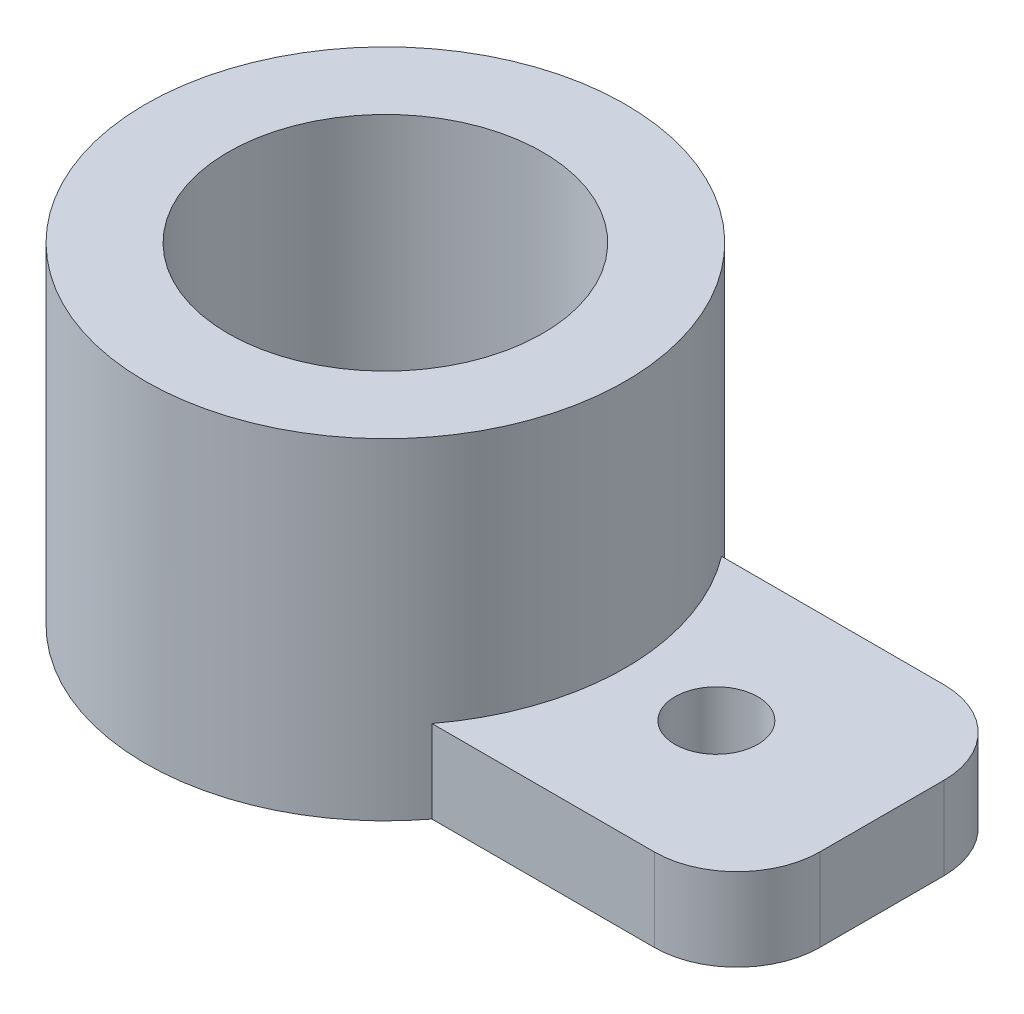
ISO-10303-21;
HEADER;
FILE_DESCRIPTION(('STEP AP214'),'2;1');
FILE_NAME('part.step','',(''),(''),'','','');
FILE_SCHEMA(('AUTOMOTIVE_DESIGN { 1 0 10303 214 1 1 1 1 }'));
ENDSEC;
DATA;
#1=APPLICATION_CONTEXT('core data for automotive mechanical design processes');
#2=APPLICATION_PROTOCOL_DEFINITION('international standard','automotive_design',2000,#1);
#3=PRODUCT_CONTEXT('',#1,'mechanical');
#4=PRODUCT('Part','Part','',(#3));
#5=PRODUCT_RELATED_PRODUCT_CATEGORY('part','',(#4));
#6=PRODUCT_DEFINITION_FORMATION('','',#4);
#7=PRODUCT_DEFINITION_CONTEXT('part definition',#1,'design');
#8=PRODUCT_DEFINITION('design','',#6,#7);
#9=PRODUCT_DEFINITION_SHAPE('','',#8);
#10=(LENGTH_UNIT() NAMED_UNIT(*) SI_UNIT(.MILLI.,.METRE.));
#11=(NAMED_UNIT(*) PLANE_ANGLE_UNIT() SI_UNIT($,.RADIAN.));
#12=(NAMED_UNIT(*) SI_UNIT($,.STERADIAN.) SOLID_ANGLE_UNIT());
#13=UNCERTAINTY_MEASURE_WITH_UNIT(LENGTH_MEASURE(1.E-05),#10,'distance_accuracy_value','');
#14=(GEOMETRIC_REPRESENTATION_CONTEXT(3) GLOBAL_UNCERTAINTY_ASSIGNED_CONTEXT((#13)) GLOBAL_UNIT_ASSIGNED_CONTEXT((#10,
#11,#12)) REPRESENTATION_CONTEXT('',''));
#15=CARTESIAN_POINT('',(0.,0.,0.));
#16=DIRECTION('',(0.,0.,1.));
#17=DIRECTION('',(1.,0.,0.));
#18=AXIS2_PLACEMENT_3D('',#15,#16,#17);
#19=CARTESIAN_POINT('',(0.,4.,0.));
#20=DIRECTION('',(0.,-1.,0.));
#21=DIRECTION('',(0.,0.,-1.));
#22=AXIS2_PLACEMENT_3D('',#19,#20,#21);
#23=CYLINDRICAL_SURFACE('',#22,1.);
#24=CARTESIAN_POINT('',(0.,0.,0.));
#25=DIRECTION('',(0.,1.,0.));
#26=DIRECTION('',(0.,0.,1.));
#27=AXIS2_PLACEMENT_3D('',#24,#25,#26);
#28=CIRCLE('',#27,1.);
#29=CARTESIAN_POINT('',(0.,0.,1.));
#30=VERTEX_POINT('',#29);
#31=EDGE_CURVE('E136',#30,#30,#28,.T.);
#32=ORIENTED_EDGE('',*,*,#31,.F.);
#33=EDGE_LOOP('',(#32));
#34=FACE_BOUND('',#33,.T.);
#35=CARTESIAN_POINT('',(0.,1.,0.));
#36=DIRECTION('',(0.,1.,0.));
#37=DIRECTION('',(0.,0.,1.));
#38=AXIS2_PLACEMENT_3D('',#35,#36,#37);
#39=CIRCLE('',#38,1.);
#40=CARTESIAN_POINT('',(0.,1.,1.));
#41=VERTEX_POINT('',#40);
#42=EDGE_CURVE('E137',#41,#41,#39,.T.);
#43=ORIENTED_EDGE('',*,*,#42,.T.);
#44=EDGE_LOOP('',(#43));
#45=FACE_BOUND('',#44,.T.);
#46=ADVANCED_FACE('F39',(#34,#45),#23,.F.);
#47=CARTESIAN_POINT('',(0.,4.,0.));
#48=DIRECTION('',(0.,-1.,0.));
#49=DIRECTION('',(0.,0.,-1.));
#50=AXIS2_PLACEMENT_3D('',#47,#48,#49);
#51=CYLINDRICAL_SURFACE('',#50,2.9);
#52=CARTESIAN_POINT('',(0.,4.,0.));
#53=DIRECTION('',(0.,1.,0.));
#54=DIRECTION('',(0.,0.,1.));
#55=AXIS2_PLACEMENT_3D('',#52,#53,#54);
#56=CIRCLE('',#55,2.9);
#57=CARTESIAN_POINT('',(0.,4.,2.9));
#58=VERTEX_POINT('',#57);
#59=EDGE_CURVE('E110',#58,#58,#56,.T.);
#60=ORIENTED_EDGE('',*,*,#59,.F.);
#61=EDGE_LOOP('',(#60));
#62=FACE_BOUND('',#61,.T.);
#63=DIRECTION('',(0.,-1.,0.));
#64=VECTOR('',#63,1.);
#65=CARTESIAN_POINT('',(2.31246621596944,4.,1.75));
#66=LINE('',#65,#64);
#67=CARTESIAN_POINT('',(2.31246621596944,1.,1.75));
#68=VERTEX_POINT('',#67);
#69=CARTESIAN_POINT('',(2.31246621596944,0.,1.75));
#70=VERTEX_POINT('',#69);
#71=EDGE_CURVE('E111',#68,#70,#66,.T.);
#72=ORIENTED_EDGE('',*,*,#71,.F.);
#73=CARTESIAN_POINT('',(0.,1.,0.));
#74=DIRECTION('',(0.,1.,0.));
#75=DIRECTION('',(0.,0.,1.));
#76=AXIS2_PLACEMENT_3D('',#73,#74,#75);
#77=CIRCLE('',#76,2.9);
#78=CARTESIAN_POINT('',(2.31246621596944,1.,-1.75));
#79=VERTEX_POINT('',#78);
#80=EDGE_CURVE('E116',#68,#79,#77,.T.);
#81=ORIENTED_EDGE('',*,*,#80,.T.);
#82=DIRECTION('',(0.,-1.,0.));
#83=VECTOR('',#82,1.);
#84=CARTESIAN_POINT('',(2.31246621596944,4.,-1.75));
#85=LINE('',#84,#83);
#86=CARTESIAN_POINT('',(2.31246621596944,0.,-1.75));
#87=VERTEX_POINT('',#86);
#88=EDGE_CURVE('E96',#87,#79,#85,.F.);
#89=ORIENTED_EDGE('',*,*,#88,.F.);
#90=CARTESIAN_POINT('',(0.,0.,0.));
#91=DIRECTION('',(0.,1.,0.));
#92=DIRECTION('',(0.,0.,1.));
#93=AXIS2_PLACEMENT_3D('',#90,#91,#92);
#94=CIRCLE('',#93,2.9);
#95=EDGE_CURVE('E104',#87,#70,#94,.T.);
#96=ORIENTED_EDGE('',*,*,#95,.T.);
#97=EDGE_LOOP('',(#72,#81,#89,#96));
#98=FACE_BOUND('',#97,.T.);
#99=ADVANCED_FACE('F114',(#62,#98),#51,.T.);
#100=CARTESIAN_POINT('',(0.,4.,0.));
#101=DIRECTION('',(0.,1.,0.));
#102=DIRECTION('',(0.,0.,1.));
#103=AXIS2_PLACEMENT_3D('',#100,#101,#102);
#104=PLANE('',#103);
#105=CARTESIAN_POINT('',(0.,4.,0.));
#106=DIRECTION('',(0.,1.,0.));
#107=DIRECTION('',(0.,0.,1.));
#108=AXIS2_PLACEMENT_3D('',#105,#106,#107);
#109=CIRCLE('',#108,1.9);
#110=CARTESIAN_POINT('',(0.,4.,1.9));
#111=VERTEX_POINT('',#110);
#112=EDGE_CURVE('E181',#111,#111,#109,.T.);
#113=ORIENTED_EDGE('',*,*,#112,.F.);
#114=EDGE_LOOP('',(#113));
#115=FACE_BOUND('',#114,.T.);
#116=ORIENTED_EDGE('',*,*,#59,.T.);
#117=EDGE_LOOP('',(#116));
#118=FACE_BOUND('',#117,.T.);
#119=ADVANCED_FACE('F221',(#115,#118),#104,.T.);
#120=CARTESIAN_POINT('',(0.,0.,0.));
#121=DIRECTION('',(0.,1.,0.));
#122=DIRECTION('',(0.,0.,1.));
#123=AXIS2_PLACEMENT_3D('',#120,#121,#122);
#124=PLANE('',#123);
#125=CARTESIAN_POINT('',(4.,0.,0.));
#126=DIRECTION('',(0.,1.,0.));
#127=DIRECTION('',(0.,0.,1.));
#128=AXIS2_PLACEMENT_3D('',#125,#126,#127);
#129=CIRCLE('',#128,0.500000000000001);
#130=CARTESIAN_POINT('',(4.,0.,0.500000000000001));
#131=VERTEX_POINT('',#130);
#132=EDGE_CURVE('E141',#131,#131,#129,.T.);
#133=ORIENTED_EDGE('',*,*,#132,.T.);
#134=EDGE_LOOP('',(#133));
#135=FACE_BOUND('',#134,.T.);
#136=ORIENTED_EDGE('',*,*,#31,.T.);
#137=EDGE_LOOP('',(#136));
#138=FACE_BOUND('',#137,.T.);
#139=DIRECTION('',(0.,0.,1.));
#140=VECTOR('',#139,1.);
#141=CARTESIAN_POINT('',(6.,0.,-1.75));
#142=LINE('',#141,#140);
#143=CARTESIAN_POINT('',(6.,0.,-0.75));
#144=VERTEX_POINT('',#143);
#145=CARTESIAN_POINT('',(6.,0.,0.75));
#146=VERTEX_POINT('',#145);
#147=EDGE_CURVE('E162',#144,#146,#142,.T.);
#148=ORIENTED_EDGE('',*,*,#147,.T.);
#149=CARTESIAN_POINT('',(5.,0.,0.75));
#150=DIRECTION('',(0.,1.,0.));
#151=DIRECTION('',(0.,0.,1.));
#152=AXIS2_PLACEMENT_3D('',#149,#150,#151);
#153=CIRCLE('',#152,1.);
#154=CARTESIAN_POINT('',(5.,0.,1.75));
#155=VERTEX_POINT('',#154);
#156=EDGE_CURVE('E48',#146,#155,#153,.F.);
#157=ORIENTED_EDGE('',*,*,#156,.T.);
#158=DIRECTION('',(1.,0.,0.));
#159=VECTOR('',#158,1.);
#160=CARTESIAN_POINT('',(14.,0.,1.75));
#161=LINE('',#160,#159);
#162=EDGE_CURVE('E101',#70,#155,#161,.T.);
#163=ORIENTED_EDGE('',*,*,#162,.F.);
#164=ORIENTED_EDGE('',*,*,#95,.F.);
#165=DIRECTION('',(-1.,0.,0.));
#166=VECTOR('',#165,1.);
#167=CARTESIAN_POINT('',(14.,0.,-1.75));
#168=LINE('',#167,#166);
#169=CARTESIAN_POINT('',(5.,0.,-1.75));
#170=VERTEX_POINT('',#169);
#171=EDGE_CURVE('E92',#170,#87,#168,.T.);
#172=ORIENTED_EDGE('',*,*,#171,.F.);
#173=CARTESIAN_POINT('',(5.,0.,-0.75));
#174=DIRECTION('',(0.,1.,0.));
#175=DIRECTION('',(0.,0.,1.));
#176=AXIS2_PLACEMENT_3D('',#173,#174,#175);
#177=CIRCLE('',#176,1.);
#178=EDGE_CURVE('E158',#170,#144,#177,.F.);
#179=ORIENTED_EDGE('',*,*,#178,.T.);
#180=EDGE_LOOP('',(#148,#157,#163,#164,#172,#179));
#181=FACE_BOUND('',#180,.T.);
#182=ADVANCED_FACE('F105',(#135,#138,#181),#124,.F.);
#183=CARTESIAN_POINT('',(14.,1.,1.75));
#184=DIRECTION('',(0.,0.,-1.));
#185=DIRECTION('',(-1.,0.,0.));
#186=AXIS2_PLACEMENT_3D('',#183,#184,#185);
#187=PLANE('',#186);
#188=ORIENTED_EDGE('',*,*,#162,.T.);
#189=DIRECTION('',(0.,1.,0.));
#190=VECTOR('',#189,1.);
#191=CARTESIAN_POINT('',(5.,1.,1.75));
#192=LINE('',#191,#190);
#193=CARTESIAN_POINT('',(5.,1.,1.75));
#194=VERTEX_POINT('',#193);
#195=EDGE_CURVE('E131',#155,#194,#192,.T.);
#196=ORIENTED_EDGE('',*,*,#195,.T.);
#197=DIRECTION('',(1.,0.,0.));
#198=VECTOR('',#197,1.);
#199=CARTESIAN_POINT('',(14.,1.,1.75));
#200=LINE('',#199,#198);
#201=EDGE_CURVE('E100',#68,#194,#200,.T.);
#202=ORIENTED_EDGE('',*,*,#201,.F.);
#203=ORIENTED_EDGE('',*,*,#71,.T.);
#204=EDGE_LOOP('',(#188,#196,#202,#203));
#205=FACE_BOUND('',#204,.T.);
#206=ADVANCED_FACE('F166',(#205),#187,.F.);
#207=CARTESIAN_POINT('',(14.,1.,-1.75));
#208=DIRECTION('',(0.,0.,1.));
#209=DIRECTION('',(1.,0.,0.));
#210=AXIS2_PLACEMENT_3D('',#207,#208,#209);
#211=PLANE('',#210);
#212=DIRECTION('',(-1.,0.,0.));
#213=VECTOR('',#212,1.);
#214=CARTESIAN_POINT('',(14.,1.,-1.75));
#215=LINE('',#214,#213);
#216=CARTESIAN_POINT('',(5.,1.,-1.75));
#217=VERTEX_POINT('',#216);
#218=EDGE_CURVE('E118',#217,#79,#215,.T.);
#219=ORIENTED_EDGE('',*,*,#218,.F.);
#220=DIRECTION('',(0.,1.,0.));
#221=VECTOR('',#220,1.);
#222=CARTESIAN_POINT('',(5.,1.,-1.75));
#223=LINE('',#222,#221);
#224=EDGE_CURVE('E11',#217,#170,#223,.F.);
#225=ORIENTED_EDGE('',*,*,#224,.T.);
#226=ORIENTED_EDGE('',*,*,#171,.T.);
#227=ORIENTED_EDGE('',*,*,#88,.T.);
#228=EDGE_LOOP('',(#219,#225,#226,#227));
#229=FACE_BOUND('',#228,.T.);
#230=ADVANCED_FACE('F94',(#229),#211,.F.);
#231=CARTESIAN_POINT('',(0.,1.,0.));
#232=DIRECTION('',(0.,1.,0.));
#233=DIRECTION('',(0.,0.,1.));
#234=AXIS2_PLACEMENT_3D('',#231,#232,#233);
#235=PLANE('',#234);
#236=ORIENTED_EDGE('',*,*,#201,.T.);
#237=CARTESIAN_POINT('',(5.,1.,0.75));
#238=DIRECTION('',(0.,1.,0.));
#239=DIRECTION('',(0.,0.,1.));
#240=AXIS2_PLACEMENT_3D('',#237,#238,#239);
#241=CIRCLE('',#240,1.);
#242=CARTESIAN_POINT('',(6.,1.,0.75));
#243=VERTEX_POINT('',#242);
#244=EDGE_CURVE('E149',#194,#243,#241,.T.);
#245=ORIENTED_EDGE('',*,*,#244,.T.);
#246=DIRECTION('',(0.,0.,1.));
#247=VECTOR('',#246,1.);
#248=CARTESIAN_POINT('',(6.,1.,-1.75));
#249=LINE('',#248,#247);
#250=CARTESIAN_POINT('',(6.,1.,-0.75));
#251=VERTEX_POINT('',#250);
#252=EDGE_CURVE('E175',#251,#243,#249,.T.);
#253=ORIENTED_EDGE('',*,*,#252,.F.);
#254=CARTESIAN_POINT('',(5.,1.,-0.75));
#255=DIRECTION('',(0.,1.,0.));
#256=DIRECTION('',(0.,0.,1.));
#257=AXIS2_PLACEMENT_3D('',#254,#255,#256);
#258=CIRCLE('',#257,1.);
#259=EDGE_CURVE('E146',#251,#217,#258,.T.);
#260=ORIENTED_EDGE('',*,*,#259,.T.);
#261=ORIENTED_EDGE('',*,*,#218,.T.);
#262=ORIENTED_EDGE('',*,*,#80,.F.);
#263=EDGE_LOOP('',(#236,#245,#253,#260,#261,#262));
#264=FACE_BOUND('',#263,.T.);
#265=CARTESIAN_POINT('',(4.,1.,0.));
#266=DIRECTION('',(0.,1.,0.));
#267=DIRECTION('',(0.,0.,1.));
#268=AXIS2_PLACEMENT_3D('',#265,#266,#267);
#269=CIRCLE('',#268,0.500000000000001);
#270=CARTESIAN_POINT('',(4.,1.,0.500000000000001));
#271=VERTEX_POINT('',#270);
#272=EDGE_CURVE('E132',#271,#271,#269,.F.);
#273=ORIENTED_EDGE('',*,*,#272,.T.);
#274=EDGE_LOOP('',(#273));
#275=FACE_BOUND('',#274,.T.);
#276=ADVANCED_FACE('F173',(#264,#275),#235,.T.);
#277=CARTESIAN_POINT('',(4.,4.,0.));
#278=DIRECTION('',(0.,-1.,0.));
#279=DIRECTION('',(0.,0.,-1.));
#280=AXIS2_PLACEMENT_3D('',#277,#278,#279);
#281=CYLINDRICAL_SURFACE('',#280,0.500000000000001);
#282=ORIENTED_EDGE('',*,*,#272,.F.);
#283=EDGE_LOOP('',(#282));
#284=FACE_BOUND('',#283,.T.);
#285=ORIENTED_EDGE('',*,*,#132,.F.);
#286=EDGE_LOOP('',(#285));
#287=FACE_BOUND('',#286,.T.);
#288=ADVANCED_FACE('F201',(#284,#287),#281,.F.);
#289=CARTESIAN_POINT('',(0.,1.,0.));
#290=DIRECTION('',(0.,1.,0.));
#291=DIRECTION('',(0.,0.,1.));
#292=AXIS2_PLACEMENT_3D('',#289,#290,#291);
#293=CYLINDRICAL_SURFACE('',#292,1.9);
#294=CARTESIAN_POINT('',(0.,1.,0.));
#295=DIRECTION('',(0.,1.,0.));
#296=DIRECTION('',(0.,0.,1.));
#297=AXIS2_PLACEMENT_3D('',#294,#295,#296);
#298=CIRCLE('',#297,1.9);
#299=CARTESIAN_POINT('',(0.,1.,1.9));
#300=VERTEX_POINT('',#299);
#301=EDGE_CURVE('E142',#300,#300,#298,.T.);
#302=ORIENTED_EDGE('',*,*,#301,.F.);
#303=EDGE_LOOP('',(#302));
#304=FACE_BOUND('',#303,.T.);
#305=ORIENTED_EDGE('',*,*,#112,.T.);
#306=EDGE_LOOP('',(#305));
#307=FACE_BOUND('',#306,.T.);
#308=ADVANCED_FACE('F203',(#304,#307),#293,.F.);
#309=CARTESIAN_POINT('',(0.,1.,0.));
#310=DIRECTION('',(0.,1.,0.));
#311=DIRECTION('',(0.,0.,1.));
#312=AXIS2_PLACEMENT_3D('',#309,#310,#311);
#313=PLANE('',#312);
#314=ORIENTED_EDGE('',*,*,#42,.F.);
#315=EDGE_LOOP('',(#314));
#316=FACE_BOUND('',#315,.T.);
#317=ORIENTED_EDGE('',*,*,#301,.T.);
#318=EDGE_LOOP('',(#317));
#319=FACE_BOUND('',#318,.T.);
#320=ADVANCED_FACE('F210',(#316,#319),#313,.T.);
#321=CARTESIAN_POINT('',(6.,0.,-1.75));
#322=DIRECTION('',(-1.,0.,0.));
#323=DIRECTION('',(0.,0.,1.));
#324=AXIS2_PLACEMENT_3D('',#321,#322,#323);
#325=PLANE('',#324);
#326=ORIENTED_EDGE('',*,*,#252,.T.);
#327=DIRECTION('',(0.,1.,0.));
#328=VECTOR('',#327,1.);
#329=CARTESIAN_POINT('',(6.,0.,0.75));
#330=LINE('',#329,#328);
#331=EDGE_CURVE('E61',#243,#146,#330,.F.);
#332=ORIENTED_EDGE('',*,*,#331,.T.);
#333=ORIENTED_EDGE('',*,*,#147,.F.);
#334=DIRECTION('',(0.,1.,0.));
#335=VECTOR('',#334,1.);
#336=CARTESIAN_POINT('',(6.,0.,-0.75));
#337=LINE('',#336,#335);
#338=EDGE_CURVE('E152',#144,#251,#337,.T.);
#339=ORIENTED_EDGE('',*,*,#338,.T.);
#340=EDGE_LOOP('',(#326,#332,#333,#339));
#341=FACE_BOUND('',#340,.T.);
#342=ADVANCED_FACE('F176',(#341),#325,.F.);
#343=CARTESIAN_POINT('',(5.,1.,0.75));
#344=DIRECTION('',(0.,1.,0.));
#345=DIRECTION('',(0.,0.,1.));
#346=AXIS2_PLACEMENT_3D('',#343,#344,#345);
#347=CYLINDRICAL_SURFACE('',#346,1.);
#348=ORIENTED_EDGE('',*,*,#156,.F.);
#349=ORIENTED_EDGE('',*,*,#331,.F.);
#350=ORIENTED_EDGE('',*,*,#244,.F.);
#351=ORIENTED_EDGE('',*,*,#195,.F.);
#352=EDGE_LOOP('',(#348,#349,#350,#351));
#353=FACE_BOUND('',#352,.T.);
#354=ADVANCED_FACE('F170',(#353),#347,.T.);
#355=CARTESIAN_POINT('',(5.,0.,-0.75));
#356=DIRECTION('',(0.,1.,0.));
#357=DIRECTION('',(0.,0.,1.));
#358=AXIS2_PLACEMENT_3D('',#355,#356,#357);
#359=CYLINDRICAL_SURFACE('',#358,1.);
#360=ORIENTED_EDGE('',*,*,#178,.F.);
#361=ORIENTED_EDGE('',*,*,#224,.F.);
#362=ORIENTED_EDGE('',*,*,#259,.F.);
#363=ORIENTED_EDGE('',*,*,#338,.F.);
#364=EDGE_LOOP('',(#360,#361,#362,#363));
#365=FACE_BOUND('',#364,.T.);
#366=ADVANCED_FACE('F41',(#365),#359,.T.);
#367=CLOSED_SHELL('',(#46,#99,#119,#182,#206,#230,#276,#288,#308,#320,#342,#354,#366));
#368=MANIFOLD_SOLID_BREP('B2',#367);
#369=ADVANCED_BREP_SHAPE_REPRESENTATION('',(#18,#368),#14);
#370=SHAPE_DEFINITION_REPRESENTATION(#9,#369);
ENDSEC;
END-ISO-10303-21;
